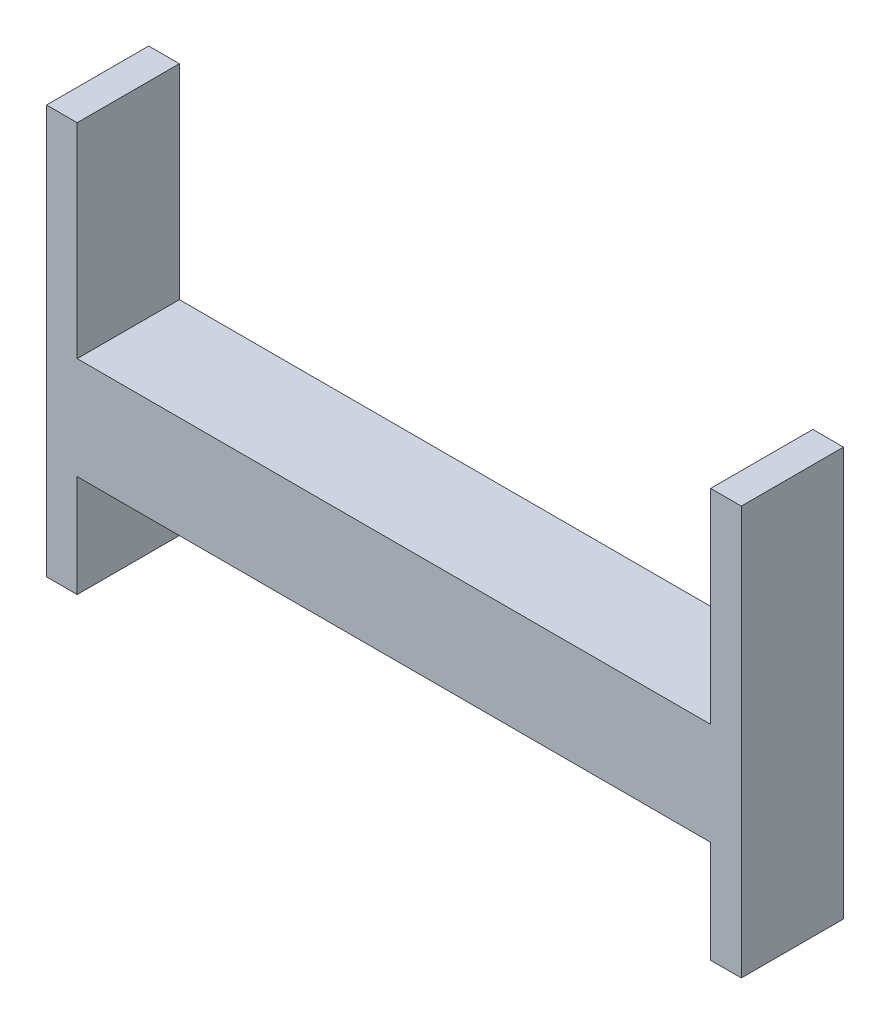
ISO-10303-21;
HEADER;
FILE_DESCRIPTION(('STEP AP214'),'2;1');
FILE_NAME('part.step','',(''),(''),'','','');
FILE_SCHEMA(('AUTOMOTIVE_DESIGN { 1 0 10303 214 1 1 1 1 }'));
ENDSEC;
DATA;
#1=APPLICATION_CONTEXT('core data for automotive mechanical design processes');
#2=APPLICATION_PROTOCOL_DEFINITION('international standard','automotive_design',2000,#1);
#3=PRODUCT_CONTEXT('',#1,'mechanical');
#4=PRODUCT('Part','Part','',(#3));
#5=PRODUCT_RELATED_PRODUCT_CATEGORY('part','',(#4));
#6=PRODUCT_DEFINITION_FORMATION('','',#4);
#7=PRODUCT_DEFINITION_CONTEXT('part definition',#1,'design');
#8=PRODUCT_DEFINITION('design','',#6,#7);
#9=PRODUCT_DEFINITION_SHAPE('','',#8);
#10=(LENGTH_UNIT() NAMED_UNIT(*) SI_UNIT(.MILLI.,.METRE.));
#11=(NAMED_UNIT(*) PLANE_ANGLE_UNIT() SI_UNIT($,.RADIAN.));
#12=(NAMED_UNIT(*) SI_UNIT($,.STERADIAN.) SOLID_ANGLE_UNIT());
#13=UNCERTAINTY_MEASURE_WITH_UNIT(LENGTH_MEASURE(1.E-05),#10,'distance_accuracy_value','');
#14=(GEOMETRIC_REPRESENTATION_CONTEXT(3) GLOBAL_UNCERTAINTY_ASSIGNED_CONTEXT((#13)) GLOBAL_UNIT_ASSIGNED_CONTEXT((#10,
#11,#12)) REPRESENTATION_CONTEXT('',''));
#15=CARTESIAN_POINT('',(0.,0.,0.));
#16=DIRECTION('',(0.,0.,1.));
#17=DIRECTION('',(1.,0.,0.));
#18=AXIS2_PLACEMENT_3D('',#15,#16,#17);
#19=CARTESIAN_POINT('',(-155.,25.,50.));
#20=DIRECTION('',(-1.,0.,0.));
#21=DIRECTION('',(0.,0.,1.));
#22=AXIS2_PLACEMENT_3D('',#19,#20,#21);
#23=PLANE('',#22);
#24=DIRECTION('',(0.,1.,0.));
#25=VECTOR('',#24,1.);
#26=CARTESIAN_POINT('',(-155.,25.,0.));
#27=LINE('',#26,#25);
#28=CARTESIAN_POINT('',(-155.,25.,0.));
#29=VERTEX_POINT('',#28);
#30=CARTESIAN_POINT('',(-155.,125.,0.));
#31=VERTEX_POINT('',#30);
#32=EDGE_CURVE('E157',#29,#31,#27,.T.);
#33=ORIENTED_EDGE('',*,*,#32,.T.);
#34=DIRECTION('',(0.,0.,-1.));
#35=VECTOR('',#34,1.);
#36=CARTESIAN_POINT('',(-155.,125.,50.));
#37=LINE('',#36,#35);
#38=CARTESIAN_POINT('',(-155.,125.,50.));
#39=VERTEX_POINT('',#38);
#40=EDGE_CURVE('E11',#39,#31,#37,.T.);
#41=ORIENTED_EDGE('',*,*,#40,.F.);
#42=DIRECTION('',(0.,1.,0.));
#43=VECTOR('',#42,1.);
#44=CARTESIAN_POINT('',(-155.,25.,50.));
#45=LINE('',#44,#43);
#46=CARTESIAN_POINT('',(-155.,25.,50.));
#47=VERTEX_POINT('',#46);
#48=EDGE_CURVE('E181',#47,#39,#45,.T.);
#49=ORIENTED_EDGE('',*,*,#48,.F.);
#50=DIRECTION('',(0.,0.,-1.));
#51=VECTOR('',#50,1.);
#52=CARTESIAN_POINT('',(-155.,25.,50.));
#53=LINE('',#52,#51);
#54=EDGE_CURVE('E153',#47,#29,#53,.T.);
#55=ORIENTED_EDGE('',*,*,#54,.T.);
#56=EDGE_LOOP('',(#33,#41,#49,#55));
#57=FACE_BOUND('',#56,.T.);
#58=ADVANCED_FACE('F37',(#57),#23,.F.);
#59=CARTESIAN_POINT('',(-155.,125.,50.));
#60=DIRECTION('',(0.,-1.,0.));
#61=DIRECTION('',(0.,0.,-1.));
#62=AXIS2_PLACEMENT_3D('',#59,#60,#61);
#63=PLANE('',#62);
#64=DIRECTION('',(-1.,0.,0.));
#65=VECTOR('',#64,1.);
#66=CARTESIAN_POINT('',(-155.,125.,0.));
#67=LINE('',#66,#65);
#68=CARTESIAN_POINT('',(-170.,125.,0.));
#69=VERTEX_POINT('',#68);
#70=EDGE_CURVE('E160',#31,#69,#67,.T.);
#71=ORIENTED_EDGE('',*,*,#70,.T.);
#72=DIRECTION('',(0.,0.,-1.));
#73=VECTOR('',#72,1.);
#74=CARTESIAN_POINT('',(-170.,125.,50.));
#75=LINE('',#74,#73);
#76=CARTESIAN_POINT('',(-170.,125.,50.));
#77=VERTEX_POINT('',#76);
#78=EDGE_CURVE('E45',#77,#69,#75,.T.);
#79=ORIENTED_EDGE('',*,*,#78,.F.);
#80=DIRECTION('',(-1.,0.,0.));
#81=VECTOR('',#80,1.);
#82=CARTESIAN_POINT('',(-155.,125.,50.));
#83=LINE('',#82,#81);
#84=EDGE_CURVE('E108',#39,#77,#83,.T.);
#85=ORIENTED_EDGE('',*,*,#84,.F.);
#86=ORIENTED_EDGE('',*,*,#40,.T.);
#87=EDGE_LOOP('',(#71,#79,#85,#86));
#88=FACE_BOUND('',#87,.T.);
#89=ADVANCED_FACE('F208',(#88),#63,.F.);
#90=CARTESIAN_POINT('',(-170.,-25.,50.));
#91=DIRECTION('',(1.,0.,0.));
#92=DIRECTION('',(0.,1.,0.));
#93=AXIS2_PLACEMENT_3D('',#90,#91,#92);
#94=PLANE('',#93);
#95=DIRECTION('',(0.,-1.,0.));
#96=VECTOR('',#95,1.);
#97=CARTESIAN_POINT('',(-170.,-25.,0.));
#98=LINE('',#97,#96);
#99=CARTESIAN_POINT('',(-170.,-75.,0.));
#100=VERTEX_POINT('',#99);
#101=EDGE_CURVE('E163',#69,#100,#98,.T.);
#102=ORIENTED_EDGE('',*,*,#101,.T.);
#103=DIRECTION('',(0.,0.,-1.));
#104=VECTOR('',#103,1.);
#105=CARTESIAN_POINT('',(-170.,-75.,50.));
#106=LINE('',#105,#104);
#107=CARTESIAN_POINT('',(-170.,-75.,50.));
#108=VERTEX_POINT('',#107);
#109=EDGE_CURVE('E200',#108,#100,#106,.T.);
#110=ORIENTED_EDGE('',*,*,#109,.F.);
#111=DIRECTION('',(0.,-1.,0.));
#112=VECTOR('',#111,1.);
#113=CARTESIAN_POINT('',(-170.,-25.,50.));
#114=LINE('',#113,#112);
#115=EDGE_CURVE('E207',#77,#108,#114,.T.);
#116=ORIENTED_EDGE('',*,*,#115,.F.);
#117=ORIENTED_EDGE('',*,*,#78,.T.);
#118=EDGE_LOOP('',(#102,#110,#116,#117));
#119=FACE_BOUND('',#118,.T.);
#120=ADVANCED_FACE('F205',(#119),#94,.F.);
#121=CARTESIAN_POINT('',(-170.,-75.,50.));
#122=DIRECTION('',(0.,1.,0.));
#123=DIRECTION('',(0.,0.,1.));
#124=AXIS2_PLACEMENT_3D('',#121,#122,#123);
#125=PLANE('',#124);
#126=DIRECTION('',(1.,0.,0.));
#127=VECTOR('',#126,1.);
#128=CARTESIAN_POINT('',(-170.,-75.,0.));
#129=LINE('',#128,#127);
#130=CARTESIAN_POINT('',(-155.,-75.,0.));
#131=VERTEX_POINT('',#130);
#132=EDGE_CURVE('E165',#100,#131,#129,.T.);
#133=ORIENTED_EDGE('',*,*,#132,.T.);
#134=DIRECTION('',(0.,0.,-1.));
#135=VECTOR('',#134,1.);
#136=CARTESIAN_POINT('',(-155.,-75.,50.));
#137=LINE('',#136,#135);
#138=CARTESIAN_POINT('',(-155.,-75.,50.));
#139=VERTEX_POINT('',#138);
#140=EDGE_CURVE('E197',#139,#131,#137,.T.);
#141=ORIENTED_EDGE('',*,*,#140,.F.);
#142=DIRECTION('',(1.,0.,0.));
#143=VECTOR('',#142,1.);
#144=CARTESIAN_POINT('',(-170.,-75.,50.));
#145=LINE('',#144,#143);
#146=EDGE_CURVE('E227',#108,#139,#145,.T.);
#147=ORIENTED_EDGE('',*,*,#146,.F.);
#148=ORIENTED_EDGE('',*,*,#109,.T.);
#149=EDGE_LOOP('',(#133,#141,#147,#148));
#150=FACE_BOUND('',#149,.T.);
#151=ADVANCED_FACE('F218',(#150),#125,.F.);
#152=CARTESIAN_POINT('',(-155.,-25.,50.));
#153=DIRECTION('',(-1.,0.,0.));
#154=DIRECTION('',(0.,0.,1.));
#155=AXIS2_PLACEMENT_3D('',#152,#153,#154);
#156=PLANE('',#155);
#157=DIRECTION('',(0.,1.,0.));
#158=VECTOR('',#157,1.);
#159=CARTESIAN_POINT('',(-155.,-25.,0.));
#160=LINE('',#159,#158);
#161=CARTESIAN_POINT('',(-155.,-25.,0.));
#162=VERTEX_POINT('',#161);
#163=EDGE_CURVE('E167',#131,#162,#160,.T.);
#164=ORIENTED_EDGE('',*,*,#163,.T.);
#165=DIRECTION('',(0.,0.,-1.));
#166=VECTOR('',#165,1.);
#167=CARTESIAN_POINT('',(-155.,-25.,50.));
#168=LINE('',#167,#166);
#169=CARTESIAN_POINT('',(-155.,-25.,50.));
#170=VERTEX_POINT('',#169);
#171=EDGE_CURVE('E194',#170,#162,#168,.T.);
#172=ORIENTED_EDGE('',*,*,#171,.F.);
#173=DIRECTION('',(0.,1.,0.));
#174=VECTOR('',#173,1.);
#175=CARTESIAN_POINT('',(-155.,-25.,50.));
#176=LINE('',#175,#174);
#177=EDGE_CURVE('E224',#139,#170,#176,.T.);
#178=ORIENTED_EDGE('',*,*,#177,.F.);
#179=ORIENTED_EDGE('',*,*,#140,.T.);
#180=EDGE_LOOP('',(#164,#172,#178,#179));
#181=FACE_BOUND('',#180,.T.);
#182=ADVANCED_FACE('F222',(#181),#156,.F.);
#183=CARTESIAN_POINT('',(155.,-25.,50.));
#184=DIRECTION('',(0.,1.,0.));
#185=DIRECTION('',(-1.,0.,0.));
#186=AXIS2_PLACEMENT_3D('',#183,#184,#185);
#187=PLANE('',#186);
#188=DIRECTION('',(1.,0.,0.));
#189=VECTOR('',#188,1.);
#190=CARTESIAN_POINT('',(155.,-25.,0.));
#191=LINE('',#190,#189);
#192=CARTESIAN_POINT('',(155.,-25.,0.));
#193=VERTEX_POINT('',#192);
#194=EDGE_CURVE('E169',#162,#193,#191,.T.);
#195=ORIENTED_EDGE('',*,*,#194,.T.);
#196=DIRECTION('',(0.,0.,-1.));
#197=VECTOR('',#196,1.);
#198=CARTESIAN_POINT('',(155.,-25.,50.));
#199=LINE('',#198,#197);
#200=CARTESIAN_POINT('',(155.,-25.,50.));
#201=VERTEX_POINT('',#200);
#202=EDGE_CURVE('E191',#201,#193,#199,.T.);
#203=ORIENTED_EDGE('',*,*,#202,.F.);
#204=DIRECTION('',(1.,0.,0.));
#205=VECTOR('',#204,1.);
#206=CARTESIAN_POINT('',(155.,-25.,50.));
#207=LINE('',#206,#205);
#208=EDGE_CURVE('E226',#170,#201,#207,.T.);
#209=ORIENTED_EDGE('',*,*,#208,.F.);
#210=ORIENTED_EDGE('',*,*,#171,.T.);
#211=EDGE_LOOP('',(#195,#203,#209,#210));
#212=FACE_BOUND('',#211,.T.);
#213=ADVANCED_FACE('F250',(#212),#187,.F.);
#214=CARTESIAN_POINT('',(155.,-25.,50.));
#215=DIRECTION('',(1.,0.,0.));
#216=DIRECTION('',(0.,0.,-1.));
#217=AXIS2_PLACEMENT_3D('',#214,#215,#216);
#218=PLANE('',#217);
#219=DIRECTION('',(0.,-1.,0.));
#220=VECTOR('',#219,1.);
#221=CARTESIAN_POINT('',(155.,-25.,0.));
#222=LINE('',#221,#220);
#223=CARTESIAN_POINT('',(155.,-75.,0.));
#224=VERTEX_POINT('',#223);
#225=EDGE_CURVE('E171',#193,#224,#222,.T.);
#226=ORIENTED_EDGE('',*,*,#225,.T.);
#227=DIRECTION('',(0.,0.,-1.));
#228=VECTOR('',#227,1.);
#229=CARTESIAN_POINT('',(155.,-75.,50.));
#230=LINE('',#229,#228);
#231=CARTESIAN_POINT('',(155.,-75.,50.));
#232=VERTEX_POINT('',#231);
#233=EDGE_CURVE('E188',#232,#224,#230,.T.);
#234=ORIENTED_EDGE('',*,*,#233,.F.);
#235=DIRECTION('',(0.,-1.,0.));
#236=VECTOR('',#235,1.);
#237=CARTESIAN_POINT('',(155.,-25.,50.));
#238=LINE('',#237,#236);
#239=EDGE_CURVE('E229',#201,#232,#238,.T.);
#240=ORIENTED_EDGE('',*,*,#239,.F.);
#241=ORIENTED_EDGE('',*,*,#202,.T.);
#242=EDGE_LOOP('',(#226,#234,#240,#241));
#243=FACE_BOUND('',#242,.T.);
#244=ADVANCED_FACE('F247',(#243),#218,.F.);
#245=CARTESIAN_POINT('',(170.,-75.,50.));
#246=DIRECTION('',(0.,1.,0.));
#247=DIRECTION('',(0.,0.,1.));
#248=AXIS2_PLACEMENT_3D('',#245,#246,#247);
#249=PLANE('',#248);
#250=DIRECTION('',(1.,0.,0.));
#251=VECTOR('',#250,1.);
#252=CARTESIAN_POINT('',(170.,-75.,0.));
#253=LINE('',#252,#251);
#254=CARTESIAN_POINT('',(170.,-75.,0.));
#255=VERTEX_POINT('',#254);
#256=EDGE_CURVE('E173',#224,#255,#253,.T.);
#257=ORIENTED_EDGE('',*,*,#256,.T.);
#258=DIRECTION('',(0.,0.,-1.));
#259=VECTOR('',#258,1.);
#260=CARTESIAN_POINT('',(170.,-75.,50.));
#261=LINE('',#260,#259);
#262=CARTESIAN_POINT('',(170.,-75.,50.));
#263=VERTEX_POINT('',#262);
#264=EDGE_CURVE('E185',#263,#255,#261,.T.);
#265=ORIENTED_EDGE('',*,*,#264,.F.);
#266=DIRECTION('',(1.,0.,0.));
#267=VECTOR('',#266,1.);
#268=CARTESIAN_POINT('',(170.,-75.,50.));
#269=LINE('',#268,#267);
#270=EDGE_CURVE('E235',#232,#263,#269,.T.);
#271=ORIENTED_EDGE('',*,*,#270,.F.);
#272=ORIENTED_EDGE('',*,*,#233,.T.);
#273=EDGE_LOOP('',(#257,#265,#271,#272));
#274=FACE_BOUND('',#273,.T.);
#275=ADVANCED_FACE('F241',(#274),#249,.F.);
#276=CARTESIAN_POINT('',(170.,-25.,50.));
#277=DIRECTION('',(-1.,0.,0.));
#278=DIRECTION('',(0.,-1.,0.));
#279=AXIS2_PLACEMENT_3D('',#276,#277,#278);
#280=PLANE('',#279);
#281=DIRECTION('',(0.,1.,0.));
#282=VECTOR('',#281,1.);
#283=CARTESIAN_POINT('',(170.,-25.,0.));
#284=LINE('',#283,#282);
#285=CARTESIAN_POINT('',(170.,125.,0.));
#286=VERTEX_POINT('',#285);
#287=EDGE_CURVE('E176',#255,#286,#284,.T.);
#288=ORIENTED_EDGE('',*,*,#287,.T.);
#289=DIRECTION('',(0.,0.,-1.));
#290=VECTOR('',#289,1.);
#291=CARTESIAN_POINT('',(170.,125.,50.));
#292=LINE('',#291,#290);
#293=CARTESIAN_POINT('',(170.,125.,50.));
#294=VERTEX_POINT('',#293);
#295=EDGE_CURVE('E148',#294,#286,#292,.T.);
#296=ORIENTED_EDGE('',*,*,#295,.F.);
#297=DIRECTION('',(0.,1.,0.));
#298=VECTOR('',#297,1.);
#299=CARTESIAN_POINT('',(170.,-25.,50.));
#300=LINE('',#299,#298);
#301=EDGE_CURVE('E139',#263,#294,#300,.T.);
#302=ORIENTED_EDGE('',*,*,#301,.F.);
#303=ORIENTED_EDGE('',*,*,#264,.T.);
#304=EDGE_LOOP('',(#288,#296,#302,#303));
#305=FACE_BOUND('',#304,.T.);
#306=ADVANCED_FACE('F244',(#305),#280,.F.);
#307=CARTESIAN_POINT('',(155.,125.,50.));
#308=DIRECTION('',(0.,-1.,0.));
#309=DIRECTION('',(0.,0.,-1.));
#310=AXIS2_PLACEMENT_3D('',#307,#308,#309);
#311=PLANE('',#310);
#312=DIRECTION('',(-1.,0.,0.));
#313=VECTOR('',#312,1.);
#314=CARTESIAN_POINT('',(155.,125.,0.));
#315=LINE('',#314,#313);
#316=CARTESIAN_POINT('',(155.,125.,0.));
#317=VERTEX_POINT('',#316);
#318=EDGE_CURVE('E147',#286,#317,#315,.T.);
#319=ORIENTED_EDGE('',*,*,#318,.T.);
#320=DIRECTION('',(0.,0.,-1.));
#321=VECTOR('',#320,1.);
#322=CARTESIAN_POINT('',(155.,125.,50.));
#323=LINE('',#322,#321);
#324=CARTESIAN_POINT('',(155.,125.,50.));
#325=VERTEX_POINT('',#324);
#326=EDGE_CURVE('E144',#325,#317,#323,.T.);
#327=ORIENTED_EDGE('',*,*,#326,.F.);
#328=DIRECTION('',(-1.,0.,0.));
#329=VECTOR('',#328,1.);
#330=CARTESIAN_POINT('',(155.,125.,50.));
#331=LINE('',#330,#329);
#332=EDGE_CURVE('E133',#294,#325,#331,.T.);
#333=ORIENTED_EDGE('',*,*,#332,.F.);
#334=ORIENTED_EDGE('',*,*,#295,.T.);
#335=EDGE_LOOP('',(#319,#327,#333,#334));
#336=FACE_BOUND('',#335,.T.);
#337=ADVANCED_FACE('F145',(#336),#311,.F.);
#338=CARTESIAN_POINT('',(155.,25.,50.));
#339=DIRECTION('',(1.,0.,0.));
#340=DIRECTION('',(0.,0.,-1.));
#341=AXIS2_PLACEMENT_3D('',#338,#339,#340);
#342=PLANE('',#341);
#343=DIRECTION('',(0.,-1.,0.));
#344=VECTOR('',#343,1.);
#345=CARTESIAN_POINT('',(155.,25.,0.));
#346=LINE('',#345,#344);
#347=CARTESIAN_POINT('',(155.,25.,0.));
#348=VERTEX_POINT('',#347);
#349=EDGE_CURVE('E94',#317,#348,#346,.T.);
#350=ORIENTED_EDGE('',*,*,#349,.T.);
#351=DIRECTION('',(0.,0.,-1.));
#352=VECTOR('',#351,1.);
#353=CARTESIAN_POINT('',(155.,25.,50.));
#354=LINE('',#353,#352);
#355=CARTESIAN_POINT('',(155.,25.,50.));
#356=VERTEX_POINT('',#355);
#357=EDGE_CURVE('E149',#356,#348,#354,.T.);
#358=ORIENTED_EDGE('',*,*,#357,.F.);
#359=DIRECTION('',(0.,-1.,0.));
#360=VECTOR('',#359,1.);
#361=CARTESIAN_POINT('',(155.,25.,50.));
#362=LINE('',#361,#360);
#363=EDGE_CURVE('E137',#325,#356,#362,.T.);
#364=ORIENTED_EDGE('',*,*,#363,.F.);
#365=ORIENTED_EDGE('',*,*,#326,.T.);
#366=EDGE_LOOP('',(#350,#358,#364,#365));
#367=FACE_BOUND('',#366,.T.);
#368=ADVANCED_FACE('F151',(#367),#342,.F.);
#369=CARTESIAN_POINT('',(155.,25.,50.));
#370=DIRECTION('',(0.,-1.,0.));
#371=DIRECTION('',(1.,0.,0.));
#372=AXIS2_PLACEMENT_3D('',#369,#370,#371);
#373=PLANE('',#372);
#374=DIRECTION('',(-1.,0.,0.));
#375=VECTOR('',#374,1.);
#376=CARTESIAN_POINT('',(155.,25.,0.));
#377=LINE('',#376,#375);
#378=EDGE_CURVE('E100',#348,#29,#377,.T.);
#379=ORIENTED_EDGE('',*,*,#378,.T.);
#380=ORIENTED_EDGE('',*,*,#54,.F.);
#381=DIRECTION('',(-1.,0.,0.));
#382=VECTOR('',#381,1.);
#383=CARTESIAN_POINT('',(155.,25.,50.));
#384=LINE('',#383,#382);
#385=EDGE_CURVE('E53',#356,#47,#384,.T.);
#386=ORIENTED_EDGE('',*,*,#385,.F.);
#387=ORIENTED_EDGE('',*,*,#357,.T.);
#388=EDGE_LOOP('',(#379,#380,#386,#387));
#389=FACE_BOUND('',#388,.T.);
#390=ADVANCED_FACE('F265',(#389),#373,.F.);
#391=CARTESIAN_POINT('',(0.,0.,50.));
#392=DIRECTION('',(0.,0.,1.));
#393=DIRECTION('',(1.,0.,0.));
#394=AXIS2_PLACEMENT_3D('',#391,#392,#393);
#395=PLANE('',#394);
#396=ORIENTED_EDGE('',*,*,#48,.T.);
#397=ORIENTED_EDGE('',*,*,#84,.T.);
#398=ORIENTED_EDGE('',*,*,#115,.T.);
#399=ORIENTED_EDGE('',*,*,#146,.T.);
#400=ORIENTED_EDGE('',*,*,#177,.T.);
#401=ORIENTED_EDGE('',*,*,#208,.T.);
#402=ORIENTED_EDGE('',*,*,#239,.T.);
#403=ORIENTED_EDGE('',*,*,#270,.T.);
#404=ORIENTED_EDGE('',*,*,#301,.T.);
#405=ORIENTED_EDGE('',*,*,#332,.T.);
#406=ORIENTED_EDGE('',*,*,#363,.T.);
#407=ORIENTED_EDGE('',*,*,#385,.T.);
#408=EDGE_LOOP('',(#396,#397,#398,#399,#400,#401,#402,#403,#404,#405,#406,#407));
#409=FACE_BOUND('',#408,.T.);
#410=ADVANCED_FACE('F135',(#409),#395,.T.);
#411=CARTESIAN_POINT('',(0.,0.,0.));
#412=DIRECTION('',(0.,0.,1.));
#413=DIRECTION('',(1.,0.,0.));
#414=AXIS2_PLACEMENT_3D('',#411,#412,#413);
#415=PLANE('',#414);
#416=ORIENTED_EDGE('',*,*,#32,.F.);
#417=ORIENTED_EDGE('',*,*,#378,.F.);
#418=ORIENTED_EDGE('',*,*,#349,.F.);
#419=ORIENTED_EDGE('',*,*,#318,.F.);
#420=ORIENTED_EDGE('',*,*,#287,.F.);
#421=ORIENTED_EDGE('',*,*,#256,.F.);
#422=ORIENTED_EDGE('',*,*,#225,.F.);
#423=ORIENTED_EDGE('',*,*,#194,.F.);
#424=ORIENTED_EDGE('',*,*,#163,.F.);
#425=ORIENTED_EDGE('',*,*,#132,.F.);
#426=ORIENTED_EDGE('',*,*,#101,.F.);
#427=ORIENTED_EDGE('',*,*,#70,.F.);
#428=EDGE_LOOP('',(#416,#417,#418,#419,#420,#421,#422,#423,#424,#425,#426,#427));
#429=FACE_BOUND('',#428,.T.);
#430=ADVANCED_FACE('F212',(#429),#415,.F.);
#431=CLOSED_SHELL('',(#58,#89,#120,#151,#182,#213,#244,#275,#306,#337,#368,#390,#410,#430));
#432=MANIFOLD_SOLID_BREP('B2',#431);
#433=ADVANCED_BREP_SHAPE_REPRESENTATION('',(#18,#432),#14);
#434=SHAPE_DEFINITION_REPRESENTATION(#9,#433);
ENDSEC;
END-ISO-10303-21;
